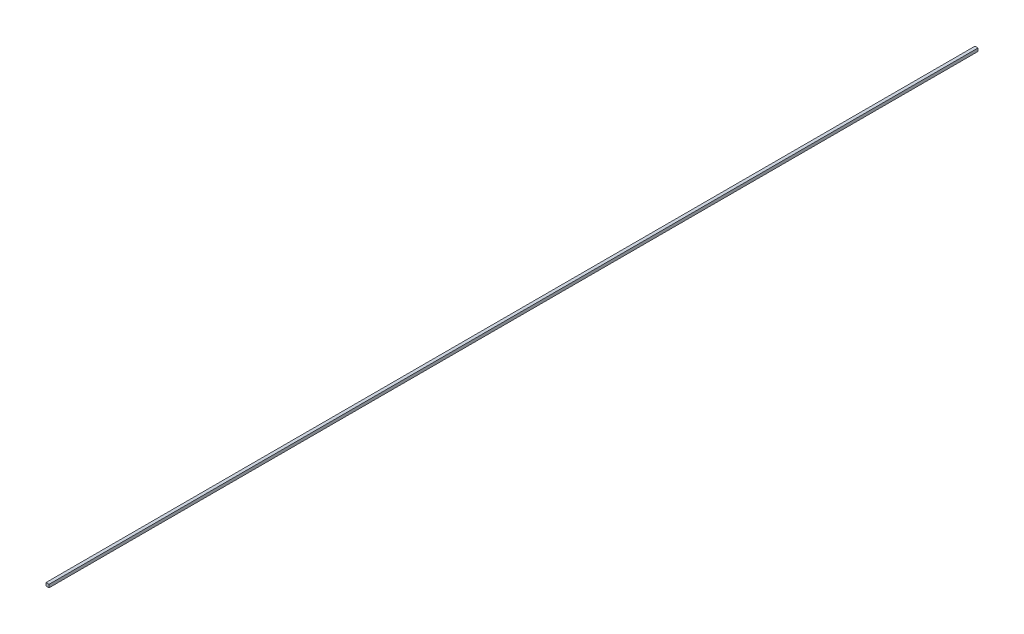
ISO-10303-21;
HEADER;
FILE_DESCRIPTION(('STEP AP214'),'2;1');
FILE_NAME('part.step','',(''),(''),'','','');
FILE_SCHEMA(('AUTOMOTIVE_DESIGN { 1 0 10303 214 1 1 1 1 }'));
ENDSEC;
DATA;
#1=APPLICATION_CONTEXT('core data for automotive mechanical design processes');
#2=APPLICATION_PROTOCOL_DEFINITION('international standard','automotive_design',2000,#1);
#3=PRODUCT_CONTEXT('',#1,'mechanical');
#4=PRODUCT('Part','Part','',(#3));
#5=PRODUCT_RELATED_PRODUCT_CATEGORY('part','',(#4));
#6=PRODUCT_DEFINITION_FORMATION('','',#4);
#7=PRODUCT_DEFINITION_CONTEXT('part definition',#1,'design');
#8=PRODUCT_DEFINITION('design','',#6,#7);
#9=PRODUCT_DEFINITION_SHAPE('','',#8);
#10=(LENGTH_UNIT() NAMED_UNIT(*) SI_UNIT(.MILLI.,.METRE.));
#11=(NAMED_UNIT(*) PLANE_ANGLE_UNIT() SI_UNIT($,.RADIAN.));
#12=(NAMED_UNIT(*) SI_UNIT($,.STERADIAN.) SOLID_ANGLE_UNIT());
#13=UNCERTAINTY_MEASURE_WITH_UNIT(LENGTH_MEASURE(1.E-05),#10,'distance_accuracy_value','');
#14=(GEOMETRIC_REPRESENTATION_CONTEXT(3) GLOBAL_UNCERTAINTY_ASSIGNED_CONTEXT((#13)) GLOBAL_UNIT_ASSIGNED_CONTEXT((#10,
#11,#12)) REPRESENTATION_CONTEXT('',''));
#15=CARTESIAN_POINT('',(0.,0.,0.));
#16=DIRECTION('',(0.,0.,1.));
#17=DIRECTION('',(1.,0.,0.));
#18=AXIS2_PLACEMENT_3D('',#15,#16,#17);
#19=CARTESIAN_POINT('',(1.,1.,604.67));
#20=DIRECTION('',(-1.,0.,0.));
#21=DIRECTION('',(0.,-1.,0.));
#22=AXIS2_PLACEMENT_3D('',#19,#20,#21);
#23=PLANE('',#22);
#24=DIRECTION('',(0.,1.,0.));
#25=VECTOR('',#24,1.);
#26=CARTESIAN_POINT('',(1.,1.,0.));
#27=LINE('',#26,#25);
#28=CARTESIAN_POINT('',(1.,-0.999999999999997,0.));
#29=VERTEX_POINT('',#28);
#30=CARTESIAN_POINT('',(1.,1.,0.));
#31=VERTEX_POINT('',#30);
#32=EDGE_CURVE('E107',#29,#31,#27,.T.);
#33=ORIENTED_EDGE('',*,*,#32,.T.);
#34=DIRECTION('',(0.,0.,-1.));
#35=VECTOR('',#34,1.);
#36=CARTESIAN_POINT('',(1.,1.,604.67));
#37=LINE('',#36,#35);
#38=CARTESIAN_POINT('',(1.,1.,604.67));
#39=VERTEX_POINT('',#38);
#40=EDGE_CURVE('E11',#39,#31,#37,.T.);
#41=ORIENTED_EDGE('',*,*,#40,.F.);
#42=DIRECTION('',(0.,1.,0.));
#43=VECTOR('',#42,1.);
#44=CARTESIAN_POINT('',(1.,1.,604.67));
#45=LINE('',#44,#43);
#46=CARTESIAN_POINT('',(1.,-0.999999999999997,604.67));
#47=VERTEX_POINT('',#46);
#48=EDGE_CURVE('E91',#47,#39,#45,.T.);
#49=ORIENTED_EDGE('',*,*,#48,.F.);
#50=DIRECTION('',(0.,0.,-1.));
#51=VECTOR('',#50,1.);
#52=CARTESIAN_POINT('',(1.,-0.999999999999997,604.67));
#53=LINE('',#52,#51);
#54=EDGE_CURVE('E103',#47,#29,#53,.T.);
#55=ORIENTED_EDGE('',*,*,#54,.T.);
#56=EDGE_LOOP('',(#33,#41,#49,#55));
#57=FACE_BOUND('',#56,.T.);
#58=ADVANCED_FACE('F39',(#57),#23,.F.);
#59=CARTESIAN_POINT('',(-0.999999999999996,1.,604.67));
#60=DIRECTION('',(0.,-1.,0.));
#61=DIRECTION('',(0.,0.,-1.));
#62=AXIS2_PLACEMENT_3D('',#59,#60,#61);
#63=PLANE('',#62);
#64=DIRECTION('',(-1.,0.,0.));
#65=VECTOR('',#64,1.);
#66=CARTESIAN_POINT('',(-0.999999999999996,1.,0.));
#67=LINE('',#66,#65);
#68=CARTESIAN_POINT('',(-0.999999999999996,1.,0.));
#69=VERTEX_POINT('',#68);
#70=EDGE_CURVE('E96',#31,#69,#67,.T.);
#71=ORIENTED_EDGE('',*,*,#70,.T.);
#72=DIRECTION('',(0.,0.,-1.));
#73=VECTOR('',#72,1.);
#74=CARTESIAN_POINT('',(-0.999999999999996,1.,604.67));
#75=LINE('',#74,#73);
#76=CARTESIAN_POINT('',(-0.999999999999996,1.,604.67));
#77=VERTEX_POINT('',#76);
#78=EDGE_CURVE('E48',#77,#69,#75,.T.);
#79=ORIENTED_EDGE('',*,*,#78,.F.);
#80=DIRECTION('',(-1.,0.,0.));
#81=VECTOR('',#80,1.);
#82=CARTESIAN_POINT('',(-0.999999999999996,1.,604.67));
#83=LINE('',#82,#81);
#84=EDGE_CURVE('E86',#39,#77,#83,.T.);
#85=ORIENTED_EDGE('',*,*,#84,.F.);
#86=ORIENTED_EDGE('',*,*,#40,.T.);
#87=EDGE_LOOP('',(#71,#79,#85,#86));
#88=FACE_BOUND('',#87,.T.);
#89=ADVANCED_FACE('F95',(#88),#63,.F.);
#90=CARTESIAN_POINT('',(-0.999999999999996,1.,604.67));
#91=DIRECTION('',(1.,0.,0.));
#92=DIRECTION('',(0.,1.,0.));
#93=AXIS2_PLACEMENT_3D('',#90,#91,#92);
#94=PLANE('',#93);
#95=DIRECTION('',(0.,-1.,0.));
#96=VECTOR('',#95,1.);
#97=CARTESIAN_POINT('',(-0.999999999999996,1.,0.));
#98=LINE('',#97,#96);
#99=CARTESIAN_POINT('',(-0.999999999999995,-0.999999999999997,0.));
#100=VERTEX_POINT('',#99);
#101=EDGE_CURVE('E73',#69,#100,#98,.T.);
#102=ORIENTED_EDGE('',*,*,#101,.T.);
#103=DIRECTION('',(0.,0.,-1.));
#104=VECTOR('',#103,1.);
#105=CARTESIAN_POINT('',(-0.999999999999995,-0.999999999999997,604.67));
#106=LINE('',#105,#104);
#107=CARTESIAN_POINT('',(-0.999999999999995,-0.999999999999997,604.67));
#108=VERTEX_POINT('',#107);
#109=EDGE_CURVE('E98',#108,#100,#106,.T.);
#110=ORIENTED_EDGE('',*,*,#109,.F.);
#111=DIRECTION('',(0.,-1.,0.));
#112=VECTOR('',#111,1.);
#113=CARTESIAN_POINT('',(-0.999999999999996,1.,604.67));
#114=LINE('',#113,#112);
#115=EDGE_CURVE('E89',#77,#108,#114,.T.);
#116=ORIENTED_EDGE('',*,*,#115,.F.);
#117=ORIENTED_EDGE('',*,*,#78,.T.);
#118=EDGE_LOOP('',(#102,#110,#116,#117));
#119=FACE_BOUND('',#118,.T.);
#120=ADVANCED_FACE('F99',(#119),#94,.F.);
#121=CARTESIAN_POINT('',(-0.999999999999995,-0.999999999999997,604.67));
#122=DIRECTION('',(0.,1.,0.));
#123=DIRECTION('',(0.,0.,1.));
#124=AXIS2_PLACEMENT_3D('',#121,#122,#123);
#125=PLANE('',#124);
#126=DIRECTION('',(1.,0.,0.));
#127=VECTOR('',#126,1.);
#128=CARTESIAN_POINT('',(-0.999999999999995,-0.999999999999997,0.));
#129=LINE('',#128,#127);
#130=EDGE_CURVE('E79',#100,#29,#129,.T.);
#131=ORIENTED_EDGE('',*,*,#130,.T.);
#132=ORIENTED_EDGE('',*,*,#54,.F.);
#133=DIRECTION('',(1.,0.,0.));
#134=VECTOR('',#133,1.);
#135=CARTESIAN_POINT('',(-0.999999999999995,-0.999999999999997,604.67));
#136=LINE('',#135,#134);
#137=EDGE_CURVE('E56',#108,#47,#136,.T.);
#138=ORIENTED_EDGE('',*,*,#137,.F.);
#139=ORIENTED_EDGE('',*,*,#109,.T.);
#140=EDGE_LOOP('',(#131,#132,#138,#139));
#141=FACE_BOUND('',#140,.T.);
#142=ADVANCED_FACE('F120',(#141),#125,.F.);
#143=CARTESIAN_POINT('',(0.,0.,604.67));
#144=DIRECTION('',(0.,0.,1.));
#145=DIRECTION('',(1.,0.,0.));
#146=AXIS2_PLACEMENT_3D('',#143,#144,#145);
#147=PLANE('',#146);
#148=ORIENTED_EDGE('',*,*,#48,.T.);
#149=ORIENTED_EDGE('',*,*,#84,.T.);
#150=ORIENTED_EDGE('',*,*,#115,.T.);
#151=ORIENTED_EDGE('',*,*,#137,.T.);
#152=EDGE_LOOP('',(#148,#149,#150,#151));
#153=FACE_BOUND('',#152,.T.);
#154=ADVANCED_FACE('F87',(#153),#147,.T.);
#155=CARTESIAN_POINT('',(0.,0.,0.));
#156=DIRECTION('',(0.,0.,1.));
#157=DIRECTION('',(1.,0.,0.));
#158=AXIS2_PLACEMENT_3D('',#155,#156,#157);
#159=PLANE('',#158);
#160=ORIENTED_EDGE('',*,*,#32,.F.);
#161=ORIENTED_EDGE('',*,*,#130,.F.);
#162=ORIENTED_EDGE('',*,*,#101,.F.);
#163=ORIENTED_EDGE('',*,*,#70,.F.);
#164=EDGE_LOOP('',(#160,#161,#162,#163));
#165=FACE_BOUND('',#164,.T.);
#166=ADVANCED_FACE('F123',(#165),#159,.F.);
#167=CLOSED_SHELL('',(#58,#89,#120,#142,#154,#166));
#168=MANIFOLD_SOLID_BREP('B2',#167);
#169=ADVANCED_BREP_SHAPE_REPRESENTATION('',(#18,#168),#14);
#170=SHAPE_DEFINITION_REPRESENTATION(#9,#169);
ENDSEC;
END-ISO-10303-21;
